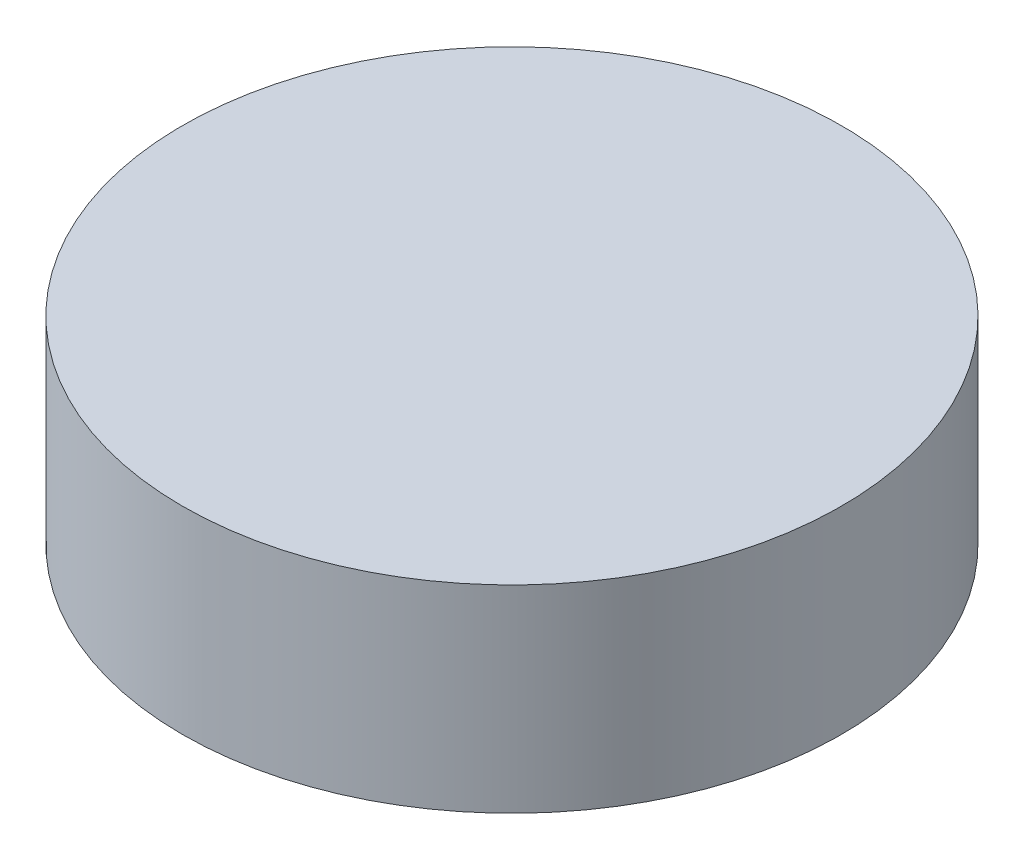
ISO-10303-21;
HEADER;
FILE_DESCRIPTION(('STEP AP214'),'2;1');
FILE_NAME('part.step','',(''),(''),'','','');
FILE_SCHEMA(('AUTOMOTIVE_DESIGN { 1 0 10303 214 1 1 1 1 }'));
ENDSEC;
DATA;
#1=APPLICATION_CONTEXT('core data for automotive mechanical design processes');
#2=APPLICATION_PROTOCOL_DEFINITION('international standard','automotive_design',2000,#1);
#3=PRODUCT_CONTEXT('',#1,'mechanical');
#4=PRODUCT('Part','Part','',(#3));
#5=PRODUCT_RELATED_PRODUCT_CATEGORY('part','',(#4));
#6=PRODUCT_DEFINITION_FORMATION('','',#4);
#7=PRODUCT_DEFINITION_CONTEXT('part definition',#1,'design');
#8=PRODUCT_DEFINITION('design','',#6,#7);
#9=PRODUCT_DEFINITION_SHAPE('','',#8);
#10=(LENGTH_UNIT() NAMED_UNIT(*) SI_UNIT(.MILLI.,.METRE.));
#11=(NAMED_UNIT(*) PLANE_ANGLE_UNIT() SI_UNIT($,.RADIAN.));
#12=(NAMED_UNIT(*) SI_UNIT($,.STERADIAN.) SOLID_ANGLE_UNIT());
#13=UNCERTAINTY_MEASURE_WITH_UNIT(LENGTH_MEASURE(1.E-05),#10,'distance_accuracy_value','');
#14=(GEOMETRIC_REPRESENTATION_CONTEXT(3) GLOBAL_UNCERTAINTY_ASSIGNED_CONTEXT((#13)) GLOBAL_UNIT_ASSIGNED_CONTEXT((#10,
#11,#12)) REPRESENTATION_CONTEXT('',''));
#15=CARTESIAN_POINT('',(0.,0.,0.));
#16=DIRECTION('',(0.,0.,1.));
#17=DIRECTION('',(1.,0.,0.));
#18=AXIS2_PLACEMENT_3D('',#15,#16,#17);
#19=CARTESIAN_POINT('',(-82.9082700941226,3.,-25.8093975133089));
#20=DIRECTION('',(0.,-1.,0.));
#21=DIRECTION('',(0.,0.,-1.));
#22=AXIS2_PLACEMENT_3D('',#19,#20,#21);
#23=CYLINDRICAL_SURFACE('',#22,5.);
#24=CARTESIAN_POINT('',(-82.9082700941226,3.,-25.8093975133089));
#25=DIRECTION('',(0.,1.,0.));
#26=DIRECTION('',(0.,0.,1.));
#27=AXIS2_PLACEMENT_3D('',#24,#25,#26);
#28=CIRCLE('',#27,5.);
#29=CARTESIAN_POINT('',(-82.9082700941226,3.,-20.8093975133089));
#30=VERTEX_POINT('',#29);
#31=EDGE_CURVE('E10',#30,#30,#28,.T.);
#32=ORIENTED_EDGE('',*,*,#31,.F.);
#33=EDGE_LOOP('',(#32));
#34=FACE_BOUND('',#33,.T.);
#35=CARTESIAN_POINT('',(-82.9082700941226,0.,-25.8093975133089));
#36=DIRECTION('',(0.,1.,0.));
#37=DIRECTION('',(0.,0.,1.));
#38=AXIS2_PLACEMENT_3D('',#35,#36,#37);
#39=CIRCLE('',#38,5.);
#40=CARTESIAN_POINT('',(-82.9082700941226,0.,-20.8093975133089));
#41=VERTEX_POINT('',#40);
#42=EDGE_CURVE('E41',#41,#41,#39,.T.);
#43=ORIENTED_EDGE('',*,*,#42,.T.);
#44=EDGE_LOOP('',(#43));
#45=FACE_BOUND('',#44,.T.);
#46=ADVANCED_FACE('F38',(#34,#45),#23,.T.);
#47=CARTESIAN_POINT('',(-82.9082700941226,3.,-25.8093975133089));
#48=DIRECTION('',(0.,1.,0.));
#49=DIRECTION('',(0.,0.,1.));
#50=AXIS2_PLACEMENT_3D('',#47,#48,#49);
#51=PLANE('',#50);
#52=ORIENTED_EDGE('',*,*,#31,.T.);
#53=EDGE_LOOP('',(#52));
#54=FACE_BOUND('',#53,.T.);
#55=ADVANCED_FACE('F53',(#54),#51,.T.);
#56=CARTESIAN_POINT('',(-82.9082700941226,0.,-25.8093975133089));
#57=DIRECTION('',(0.,1.,0.));
#58=DIRECTION('',(0.,0.,1.));
#59=AXIS2_PLACEMENT_3D('',#56,#57,#58);
#60=PLANE('',#59);
#61=ORIENTED_EDGE('',*,*,#42,.F.);
#62=EDGE_LOOP('',(#61));
#63=FACE_BOUND('',#62,.T.);
#64=ADVANCED_FACE('F51',(#63),#60,.F.);
#65=CLOSED_SHELL('',(#46,#55,#64));
#66=MANIFOLD_SOLID_BREP('B2',#65);
#67=ADVANCED_BREP_SHAPE_REPRESENTATION('',(#18,#66),#14);
#68=SHAPE_DEFINITION_REPRESENTATION(#9,#67);
ENDSEC;
END-ISO-10303-21;
